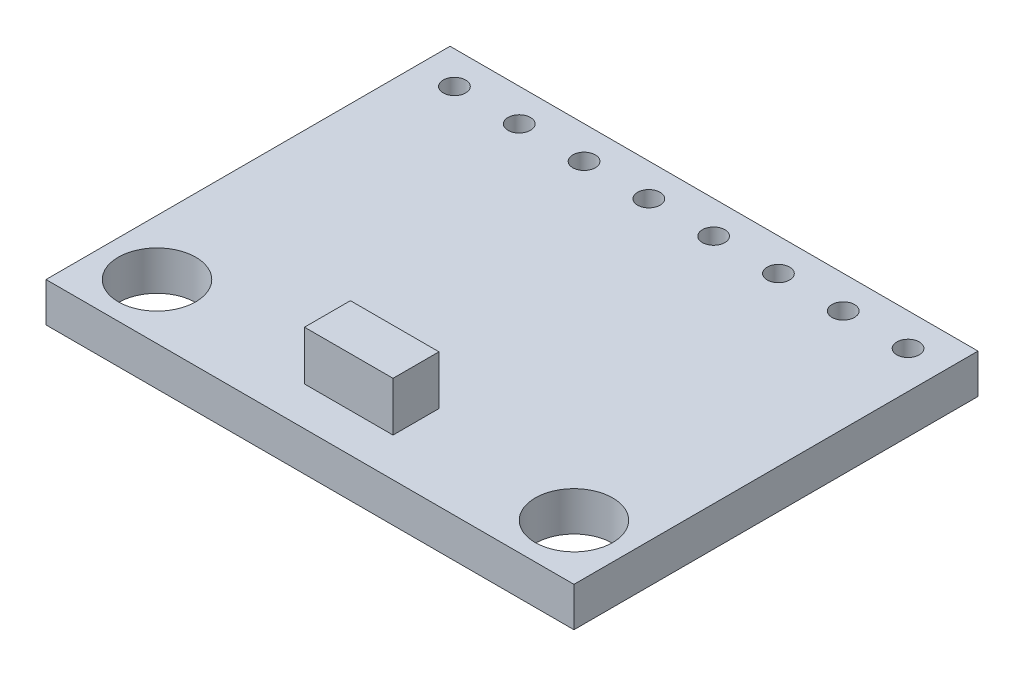
ISO-10303-21;
HEADER;
FILE_DESCRIPTION(('STEP AP214'),'2;1');
FILE_NAME('part.step','',(''),(''),'','','');
FILE_SCHEMA(('AUTOMOTIVE_DESIGN { 1 0 10303 214 1 1 1 1 }'));
ENDSEC;
DATA;
#1=APPLICATION_CONTEXT('core data for automotive mechanical design processes');
#2=APPLICATION_PROTOCOL_DEFINITION('international standard','automotive_design',2000,#1);
#3=PRODUCT_CONTEXT('',#1,'mechanical');
#4=PRODUCT('Part','Part','',(#3));
#5=PRODUCT_RELATED_PRODUCT_CATEGORY('part','',(#4));
#6=PRODUCT_DEFINITION_FORMATION('','',#4);
#7=PRODUCT_DEFINITION_CONTEXT('part definition',#1,'design');
#8=PRODUCT_DEFINITION('design','',#6,#7);
#9=PRODUCT_DEFINITION_SHAPE('','',#8);
#10=(LENGTH_UNIT() NAMED_UNIT(*) SI_UNIT(.MILLI.,.METRE.));
#11=(NAMED_UNIT(*) PLANE_ANGLE_UNIT() SI_UNIT($,.RADIAN.));
#12=(NAMED_UNIT(*) SI_UNIT($,.STERADIAN.) SOLID_ANGLE_UNIT());
#13=UNCERTAINTY_MEASURE_WITH_UNIT(LENGTH_MEASURE(1.E-05),#10,'distance_accuracy_value','');
#14=(GEOMETRIC_REPRESENTATION_CONTEXT(3) GLOBAL_UNCERTAINTY_ASSIGNED_CONTEXT((#13)) GLOBAL_UNIT_ASSIGNED_CONTEXT((#10,
#11,#12)) REPRESENTATION_CONTEXT('',''));
#15=CARTESIAN_POINT('',(0.,0.,0.));
#16=DIRECTION('',(0.,0.,1.));
#17=DIRECTION('',(1.,0.,0.));
#18=AXIS2_PLACEMENT_3D('',#15,#16,#17);
#19=CARTESIAN_POINT('',(0.,1.524,0.));
#20=DIRECTION('',(0.,-1.,0.));
#21=DIRECTION('',(0.,0.,-1.));
#22=AXIS2_PLACEMENT_3D('',#19,#20,#21);
#23=PLANE('',#22);
#24=CARTESIAN_POINT('',(19.005,1.524,-14.385));
#25=DIRECTION('',(0.,1.,0.));
#26=DIRECTION('',(0.,0.,1.));
#27=AXIS2_PLACEMENT_3D('',#24,#25,#26);
#28=CIRCLE('',#27,0.435);
#29=CARTESIAN_POINT('',(19.005,1.524,-13.95));
#30=VERTEX_POINT('',#29);
#31=EDGE_CURVE('E140',#30,#30,#28,.T.);
#32=ORIENTED_EDGE('',*,*,#31,.F.);
#33=EDGE_LOOP('',(#32));
#34=FACE_BOUND('',#33,.T.);
#35=CARTESIAN_POINT('',(16.495,1.524,-14.385));
#36=DIRECTION('',(0.,1.,0.));
#37=DIRECTION('',(0.,0.,1.));
#38=AXIS2_PLACEMENT_3D('',#35,#36,#37);
#39=CIRCLE('',#38,0.434999999999993);
#40=CARTESIAN_POINT('',(16.495,1.524,-13.95));
#41=VERTEX_POINT('',#40);
#42=EDGE_CURVE('E149',#41,#41,#39,.T.);
#43=ORIENTED_EDGE('',*,*,#42,.F.);
#44=EDGE_LOOP('',(#43));
#45=FACE_BOUND('',#44,.T.);
#46=CARTESIAN_POINT('',(3.94500000000001,1.524,-14.385));
#47=DIRECTION('',(0.,1.,0.));
#48=DIRECTION('',(0.,0.,1.));
#49=AXIS2_PLACEMENT_3D('',#46,#47,#48);
#50=CIRCLE('',#49,0.435000000000001);
#51=CARTESIAN_POINT('',(3.94500000000001,1.524,-13.95));
#52=VERTEX_POINT('',#51);
#53=EDGE_CURVE('E155',#52,#52,#50,.T.);
#54=ORIENTED_EDGE('',*,*,#53,.F.);
#55=EDGE_LOOP('',(#54));
#56=FACE_BOUND('',#55,.T.);
#57=CARTESIAN_POINT('',(11.475,1.524,-14.385));
#58=DIRECTION('',(0.,1.,0.));
#59=DIRECTION('',(0.,0.,1.));
#60=AXIS2_PLACEMENT_3D('',#57,#58,#59);
#61=CIRCLE('',#60,0.435);
#62=CARTESIAN_POINT('',(11.475,1.524,-13.95));
#63=VERTEX_POINT('',#62);
#64=EDGE_CURVE('E161',#63,#63,#61,.T.);
#65=ORIENTED_EDGE('',*,*,#64,.F.);
#66=EDGE_LOOP('',(#65));
#67=FACE_BOUND('',#66,.T.);
#68=CARTESIAN_POINT('',(13.985,1.524,-14.385));
#69=DIRECTION('',(0.,1.,0.));
#70=DIRECTION('',(0.,0.,1.));
#71=AXIS2_PLACEMENT_3D('',#68,#69,#70);
#72=CIRCLE('',#71,0.435);
#73=CARTESIAN_POINT('',(13.985,1.524,-13.95));
#74=VERTEX_POINT('',#73);
#75=EDGE_CURVE('E167',#74,#74,#72,.T.);
#76=ORIENTED_EDGE('',*,*,#75,.F.);
#77=EDGE_LOOP('',(#76));
#78=FACE_BOUND('',#77,.T.);
#79=CARTESIAN_POINT('',(6.45500000000001,1.524,-14.385));
#80=DIRECTION('',(0.,1.,0.));
#81=DIRECTION('',(0.,0.,1.));
#82=AXIS2_PLACEMENT_3D('',#79,#80,#81);
#83=CIRCLE('',#82,0.435);
#84=CARTESIAN_POINT('',(6.45500000000001,1.524,-13.95));
#85=VERTEX_POINT('',#84);
#86=EDGE_CURVE('E173',#85,#85,#83,.T.);
#87=ORIENTED_EDGE('',*,*,#86,.F.);
#88=EDGE_LOOP('',(#87));
#89=FACE_BOUND('',#88,.T.);
#90=CARTESIAN_POINT('',(1.43500000000001,1.524,-14.385));
#91=DIRECTION('',(0.,1.,0.));
#92=DIRECTION('',(0.,0.,1.));
#93=AXIS2_PLACEMENT_3D('',#90,#91,#92);
#94=CIRCLE('',#93,0.435);
#95=CARTESIAN_POINT('',(1.43500000000001,1.524,-13.95));
#96=VERTEX_POINT('',#95);
#97=EDGE_CURVE('E179',#96,#96,#94,.T.);
#98=ORIENTED_EDGE('',*,*,#97,.F.);
#99=EDGE_LOOP('',(#98));
#100=FACE_BOUND('',#99,.T.);
#101=CARTESIAN_POINT('',(8.96500000000001,1.524,-14.385));
#102=DIRECTION('',(0.,1.,0.));
#103=DIRECTION('',(0.,0.,1.));
#104=AXIS2_PLACEMENT_3D('',#101,#102,#103);
#105=CIRCLE('',#104,0.435);
#106=CARTESIAN_POINT('',(8.96500000000001,1.524,-13.95));
#107=VERTEX_POINT('',#106);
#108=EDGE_CURVE('E185',#107,#107,#105,.T.);
#109=ORIENTED_EDGE('',*,*,#108,.F.);
#110=EDGE_LOOP('',(#109));
#111=FACE_BOUND('',#110,.T.);
#112=CARTESIAN_POINT('',(18.3,1.524,-2.15));
#113=DIRECTION('',(0.,1.,0.));
#114=DIRECTION('',(0.,0.,1.));
#115=AXIS2_PLACEMENT_3D('',#112,#113,#114);
#116=CIRCLE('',#115,1.5);
#117=CARTESIAN_POINT('',(18.3,1.524,-0.650000000000001));
#118=VERTEX_POINT('',#117);
#119=EDGE_CURVE('E191',#118,#118,#116,.T.);
#120=ORIENTED_EDGE('',*,*,#119,.F.);
#121=EDGE_LOOP('',(#120));
#122=FACE_BOUND('',#121,.T.);
#123=CARTESIAN_POINT('',(2.15,1.524,-2.15));
#124=DIRECTION('',(0.,1.,0.));
#125=DIRECTION('',(0.,0.,1.));
#126=AXIS2_PLACEMENT_3D('',#123,#124,#125);
#127=CIRCLE('',#126,1.5);
#128=CARTESIAN_POINT('',(2.15,1.524,-0.65));
#129=VERTEX_POINT('',#128);
#130=EDGE_CURVE('E197',#129,#129,#127,.T.);
#131=ORIENTED_EDGE('',*,*,#130,.F.);
#132=EDGE_LOOP('',(#131));
#133=FACE_BOUND('',#132,.T.);
#134=DIRECTION('',(0.,0.,1.));
#135=VECTOR('',#134,1.);
#136=CARTESIAN_POINT('',(0.,1.524,0.));
#137=LINE('',#136,#135);
#138=CARTESIAN_POINT('',(0.,1.524,-15.65));
#139=VERTEX_POINT('',#138);
#140=CARTESIAN_POINT('',(0.,1.524,0.));
#141=VERTEX_POINT('',#140);
#142=EDGE_CURVE('E203',#139,#141,#137,.T.);
#143=ORIENTED_EDGE('',*,*,#142,.T.);
#144=DIRECTION('',(1.,0.,0.));
#145=VECTOR('',#144,1.);
#146=CARTESIAN_POINT('',(0.,1.524,0.));
#147=LINE('',#146,#145);
#148=CARTESIAN_POINT('',(20.45,1.524,0.));
#149=VERTEX_POINT('',#148);
#150=EDGE_CURVE('E206',#141,#149,#147,.T.);
#151=ORIENTED_EDGE('',*,*,#150,.T.);
#152=DIRECTION('',(0.,0.,-1.));
#153=VECTOR('',#152,1.);
#154=CARTESIAN_POINT('',(20.45,1.524,0.));
#155=LINE('',#154,#153);
#156=CARTESIAN_POINT('',(20.45,1.524,-15.65));
#157=VERTEX_POINT('',#156);
#158=EDGE_CURVE('E209',#149,#157,#155,.T.);
#159=ORIENTED_EDGE('',*,*,#158,.T.);
#160=DIRECTION('',(-1.,0.,0.));
#161=VECTOR('',#160,1.);
#162=CARTESIAN_POINT('',(0.,1.524,-15.65));
#163=LINE('',#162,#161);
#164=EDGE_CURVE('E211',#157,#139,#163,.T.);
#165=ORIENTED_EDGE('',*,*,#164,.T.);
#166=EDGE_LOOP('',(#143,#151,#159,#165));
#167=FACE_BOUND('',#166,.T.);
#168=DIRECTION('',(0.,0.,1.));
#169=VECTOR('',#168,1.);
#170=CARTESIAN_POINT('',(8.5105,1.524,-3.28036426337536));
#171=LINE('',#170,#169);
#172=CARTESIAN_POINT('',(8.5105,1.524,-3.28036426337536));
#173=VERTEX_POINT('',#172);
#174=CARTESIAN_POINT('',(8.5105,1.524,-1.50236426337536));
#175=VERTEX_POINT('',#174);
#176=EDGE_CURVE('E136',#173,#175,#171,.T.);
#177=ORIENTED_EDGE('',*,*,#176,.F.);
#178=DIRECTION('',(-1.,0.,0.));
#179=VECTOR('',#178,1.);
#180=CARTESIAN_POINT('',(8.5105,1.524,-3.28036426337536));
#181=LINE('',#180,#179);
#182=CARTESIAN_POINT('',(11.9395,1.524,-3.28036426337536));
#183=VERTEX_POINT('',#182);
#184=EDGE_CURVE('E133',#183,#173,#181,.T.);
#185=ORIENTED_EDGE('',*,*,#184,.F.);
#186=DIRECTION('',(0.,0.,-1.));
#187=VECTOR('',#186,1.);
#188=CARTESIAN_POINT('',(11.9395,1.524,-3.28036426337536));
#189=LINE('',#188,#187);
#190=CARTESIAN_POINT('',(11.9395,1.524,-1.50236426337536));
#191=VERTEX_POINT('',#190);
#192=EDGE_CURVE('E71',#191,#183,#189,.T.);
#193=ORIENTED_EDGE('',*,*,#192,.F.);
#194=DIRECTION('',(1.,0.,0.));
#195=VECTOR('',#194,1.);
#196=CARTESIAN_POINT('',(8.5105,1.524,-1.50236426337536));
#197=LINE('',#196,#195);
#198=EDGE_CURVE('E66',#175,#191,#197,.T.);
#199=ORIENTED_EDGE('',*,*,#198,.F.);
#200=EDGE_LOOP('',(#177,#185,#193,#199));
#201=FACE_BOUND('',#200,.T.);
#202=ADVANCED_FACE('F51',(#34,#45,#56,#67,#78,#89,#100,#111,#122,#133,#167,#201),#23,.F.);
#203=CARTESIAN_POINT('',(0.,0.,0.));
#204=DIRECTION('',(0.,-1.,0.));
#205=DIRECTION('',(0.,0.,-1.));
#206=AXIS2_PLACEMENT_3D('',#203,#204,#205);
#207=PLANE('',#206);
#208=CARTESIAN_POINT('',(16.495,0.,-14.385));
#209=DIRECTION('',(0.,1.,0.));
#210=DIRECTION('',(0.,0.,1.));
#211=AXIS2_PLACEMENT_3D('',#208,#209,#210);
#212=CIRCLE('',#211,0.434999999999993);
#213=CARTESIAN_POINT('',(16.495,0.,-13.95));
#214=VERTEX_POINT('',#213);
#215=EDGE_CURVE('E147',#214,#214,#212,.T.);
#216=ORIENTED_EDGE('',*,*,#215,.T.);
#217=EDGE_LOOP('',(#216));
#218=FACE_BOUND('',#217,.T.);
#219=CARTESIAN_POINT('',(11.475,0.,-14.385));
#220=DIRECTION('',(0.,1.,0.));
#221=DIRECTION('',(0.,0.,1.));
#222=AXIS2_PLACEMENT_3D('',#219,#220,#221);
#223=CIRCLE('',#222,0.435);
#224=CARTESIAN_POINT('',(11.475,0.,-13.95));
#225=VERTEX_POINT('',#224);
#226=EDGE_CURVE('E158',#225,#225,#223,.T.);
#227=ORIENTED_EDGE('',*,*,#226,.T.);
#228=EDGE_LOOP('',(#227));
#229=FACE_BOUND('',#228,.T.);
#230=CARTESIAN_POINT('',(6.45500000000001,0.,-14.385));
#231=DIRECTION('',(0.,1.,0.));
#232=DIRECTION('',(0.,0.,1.));
#233=AXIS2_PLACEMENT_3D('',#230,#231,#232);
#234=CIRCLE('',#233,0.435);
#235=CARTESIAN_POINT('',(6.45500000000001,0.,-13.95));
#236=VERTEX_POINT('',#235);
#237=EDGE_CURVE('E170',#236,#236,#234,.T.);
#238=ORIENTED_EDGE('',*,*,#237,.T.);
#239=EDGE_LOOP('',(#238));
#240=FACE_BOUND('',#239,.T.);
#241=CARTESIAN_POINT('',(8.96500000000001,0.,-14.385));
#242=DIRECTION('',(0.,1.,0.));
#243=DIRECTION('',(0.,0.,1.));
#244=AXIS2_PLACEMENT_3D('',#241,#242,#243);
#245=CIRCLE('',#244,0.435);
#246=CARTESIAN_POINT('',(8.96500000000001,0.,-13.95));
#247=VERTEX_POINT('',#246);
#248=EDGE_CURVE('E182',#247,#247,#245,.T.);
#249=ORIENTED_EDGE('',*,*,#248,.T.);
#250=EDGE_LOOP('',(#249));
#251=FACE_BOUND('',#250,.T.);
#252=CARTESIAN_POINT('',(2.15,0.,-2.15));
#253=DIRECTION('',(0.,1.,0.));
#254=DIRECTION('',(0.,0.,1.));
#255=AXIS2_PLACEMENT_3D('',#252,#253,#254);
#256=CIRCLE('',#255,1.5);
#257=CARTESIAN_POINT('',(2.15,0.,-0.65));
#258=VERTEX_POINT('',#257);
#259=EDGE_CURVE('E194',#258,#258,#256,.T.);
#260=ORIENTED_EDGE('',*,*,#259,.T.);
#261=EDGE_LOOP('',(#260));
#262=FACE_BOUND('',#261,.T.);
#263=DIRECTION('',(0.,0.,1.));
#264=VECTOR('',#263,1.);
#265=CARTESIAN_POINT('',(0.,0.,0.));
#266=LINE('',#265,#264);
#267=CARTESIAN_POINT('',(0.,0.,-15.65));
#268=VERTEX_POINT('',#267);
#269=CARTESIAN_POINT('',(0.,0.,0.));
#270=VERTEX_POINT('',#269);
#271=EDGE_CURVE('E200',#268,#270,#266,.T.);
#272=ORIENTED_EDGE('',*,*,#271,.F.);
#273=DIRECTION('',(-1.,0.,0.));
#274=VECTOR('',#273,1.);
#275=CARTESIAN_POINT('',(0.,0.,-15.65));
#276=LINE('',#275,#274);
#277=CARTESIAN_POINT('',(20.45,0.,-15.65));
#278=VERTEX_POINT('',#277);
#279=EDGE_CURVE('E207',#278,#268,#276,.T.);
#280=ORIENTED_EDGE('',*,*,#279,.F.);
#281=DIRECTION('',(0.,0.,-1.));
#282=VECTOR('',#281,1.);
#283=CARTESIAN_POINT('',(20.45,0.,0.));
#284=LINE('',#283,#282);
#285=CARTESIAN_POINT('',(20.45,0.,0.));
#286=VERTEX_POINT('',#285);
#287=EDGE_CURVE('E218',#286,#278,#284,.T.);
#288=ORIENTED_EDGE('',*,*,#287,.F.);
#289=DIRECTION('',(1.,0.,0.));
#290=VECTOR('',#289,1.);
#291=CARTESIAN_POINT('',(0.,0.,0.));
#292=LINE('',#291,#290);
#293=EDGE_CURVE('E216',#270,#286,#292,.T.);
#294=ORIENTED_EDGE('',*,*,#293,.F.);
#295=EDGE_LOOP('',(#272,#280,#288,#294));
#296=FACE_BOUND('',#295,.T.);
#297=CARTESIAN_POINT('',(18.3,0.,-2.15));
#298=DIRECTION('',(0.,1.,0.));
#299=DIRECTION('',(0.,0.,1.));
#300=AXIS2_PLACEMENT_3D('',#297,#298,#299);
#301=CIRCLE('',#300,1.5);
#302=CARTESIAN_POINT('',(18.3,0.,-0.650000000000001));
#303=VERTEX_POINT('',#302);
#304=EDGE_CURVE('E188',#303,#303,#301,.T.);
#305=ORIENTED_EDGE('',*,*,#304,.T.);
#306=EDGE_LOOP('',(#305));
#307=FACE_BOUND('',#306,.T.);
#308=CARTESIAN_POINT('',(1.43500000000001,0.,-14.385));
#309=DIRECTION('',(0.,1.,0.));
#310=DIRECTION('',(0.,0.,1.));
#311=AXIS2_PLACEMENT_3D('',#308,#309,#310);
#312=CIRCLE('',#311,0.435);
#313=CARTESIAN_POINT('',(1.43500000000001,0.,-13.95));
#314=VERTEX_POINT('',#313);
#315=EDGE_CURVE('E176',#314,#314,#312,.T.);
#316=ORIENTED_EDGE('',*,*,#315,.T.);
#317=EDGE_LOOP('',(#316));
#318=FACE_BOUND('',#317,.T.);
#319=CARTESIAN_POINT('',(13.985,0.,-14.385));
#320=DIRECTION('',(0.,1.,0.));
#321=DIRECTION('',(0.,0.,1.));
#322=AXIS2_PLACEMENT_3D('',#319,#320,#321);
#323=CIRCLE('',#322,0.435);
#324=CARTESIAN_POINT('',(13.985,0.,-13.95));
#325=VERTEX_POINT('',#324);
#326=EDGE_CURVE('E164',#325,#325,#323,.T.);
#327=ORIENTED_EDGE('',*,*,#326,.T.);
#328=EDGE_LOOP('',(#327));
#329=FACE_BOUND('',#328,.T.);
#330=CARTESIAN_POINT('',(3.94500000000001,0.,-14.385));
#331=DIRECTION('',(0.,1.,0.));
#332=DIRECTION('',(0.,0.,1.));
#333=AXIS2_PLACEMENT_3D('',#330,#331,#332);
#334=CIRCLE('',#333,0.435000000000001);
#335=CARTESIAN_POINT('',(3.94500000000001,0.,-13.95));
#336=VERTEX_POINT('',#335);
#337=EDGE_CURVE('E152',#336,#336,#334,.T.);
#338=ORIENTED_EDGE('',*,*,#337,.T.);
#339=EDGE_LOOP('',(#338));
#340=FACE_BOUND('',#339,.T.);
#341=CARTESIAN_POINT('',(19.005,0.,-14.385));
#342=DIRECTION('',(0.,1.,0.));
#343=DIRECTION('',(0.,0.,1.));
#344=AXIS2_PLACEMENT_3D('',#341,#342,#343);
#345=CIRCLE('',#344,0.435);
#346=CARTESIAN_POINT('',(19.005,0.,-13.95));
#347=VERTEX_POINT('',#346);
#348=EDGE_CURVE('E137',#347,#347,#345,.T.);
#349=ORIENTED_EDGE('',*,*,#348,.T.);
#350=EDGE_LOOP('',(#349));
#351=FACE_BOUND('',#350,.T.);
#352=ADVANCED_FACE('F236',(#218,#229,#240,#251,#262,#296,#307,#318,#329,#340,#351),#207,.T.);
#353=CARTESIAN_POINT('',(0.,1.524,0.));
#354=DIRECTION('',(1.,0.,0.));
#355=DIRECTION('',(0.,0.,-1.));
#356=AXIS2_PLACEMENT_3D('',#353,#354,#355);
#357=PLANE('',#356);
#358=ORIENTED_EDGE('',*,*,#271,.T.);
#359=DIRECTION('',(0.,-1.,0.));
#360=VECTOR('',#359,1.);
#361=CARTESIAN_POINT('',(0.,1.524,0.));
#362=LINE('',#361,#360);
#363=EDGE_CURVE('E11',#141,#270,#362,.T.);
#364=ORIENTED_EDGE('',*,*,#363,.F.);
#365=ORIENTED_EDGE('',*,*,#142,.F.);
#366=DIRECTION('',(0.,-1.,0.));
#367=VECTOR('',#366,1.);
#368=CARTESIAN_POINT('',(0.,1.524,-15.65));
#369=LINE('',#368,#367);
#370=EDGE_CURVE('E213',#139,#268,#369,.T.);
#371=ORIENTED_EDGE('',*,*,#370,.T.);
#372=EDGE_LOOP('',(#358,#364,#365,#371));
#373=FACE_BOUND('',#372,.T.);
#374=ADVANCED_FACE('F53',(#373),#357,.F.);
#375=CARTESIAN_POINT('',(0.,1.524,0.));
#376=DIRECTION('',(0.,0.,-1.));
#377=DIRECTION('',(-1.,0.,0.));
#378=AXIS2_PLACEMENT_3D('',#375,#376,#377);
#379=PLANE('',#378);
#380=ORIENTED_EDGE('',*,*,#293,.T.);
#381=DIRECTION('',(0.,-1.,0.));
#382=VECTOR('',#381,1.);
#383=CARTESIAN_POINT('',(20.45,1.524,0.));
#384=LINE('',#383,#382);
#385=EDGE_CURVE('E59',#149,#286,#384,.T.);
#386=ORIENTED_EDGE('',*,*,#385,.F.);
#387=ORIENTED_EDGE('',*,*,#150,.F.);
#388=ORIENTED_EDGE('',*,*,#363,.T.);
#389=EDGE_LOOP('',(#380,#386,#387,#388));
#390=FACE_BOUND('',#389,.T.);
#391=ADVANCED_FACE('F246',(#390),#379,.F.);
#392=CARTESIAN_POINT('',(20.45,1.524,0.));
#393=DIRECTION('',(-1.,0.,0.));
#394=DIRECTION('',(0.,0.,1.));
#395=AXIS2_PLACEMENT_3D('',#392,#393,#394);
#396=PLANE('',#395);
#397=ORIENTED_EDGE('',*,*,#287,.T.);
#398=DIRECTION('',(0.,-1.,0.));
#399=VECTOR('',#398,1.);
#400=CARTESIAN_POINT('',(20.45,1.524,-15.65));
#401=LINE('',#400,#399);
#402=EDGE_CURVE('E223',#157,#278,#401,.T.);
#403=ORIENTED_EDGE('',*,*,#402,.F.);
#404=ORIENTED_EDGE('',*,*,#158,.F.);
#405=ORIENTED_EDGE('',*,*,#385,.T.);
#406=EDGE_LOOP('',(#397,#403,#404,#405));
#407=FACE_BOUND('',#406,.T.);
#408=ADVANCED_FACE('F230',(#407),#396,.F.);
#409=CARTESIAN_POINT('',(0.,1.524,-15.65));
#410=DIRECTION('',(0.,0.,1.));
#411=DIRECTION('',(1.,0.,0.));
#412=AXIS2_PLACEMENT_3D('',#409,#410,#411);
#413=PLANE('',#412);
#414=ORIENTED_EDGE('',*,*,#279,.T.);
#415=ORIENTED_EDGE('',*,*,#370,.F.);
#416=ORIENTED_EDGE('',*,*,#164,.F.);
#417=ORIENTED_EDGE('',*,*,#402,.T.);
#418=EDGE_LOOP('',(#414,#415,#416,#417));
#419=FACE_BOUND('',#418,.T.);
#420=ADVANCED_FACE('F240',(#419),#413,.F.);
#421=CARTESIAN_POINT('',(2.15,1.524,-2.15));
#422=DIRECTION('',(0.,-1.,0.));
#423=DIRECTION('',(0.,0.,-1.));
#424=AXIS2_PLACEMENT_3D('',#421,#422,#423);
#425=CYLINDRICAL_SURFACE('',#424,1.5);
#426=ORIENTED_EDGE('',*,*,#130,.T.);
#427=EDGE_LOOP('',(#426));
#428=FACE_BOUND('',#427,.T.);
#429=ORIENTED_EDGE('',*,*,#259,.F.);
#430=EDGE_LOOP('',(#429));
#431=FACE_BOUND('',#430,.T.);
#432=ADVANCED_FACE('F266',(#428,#431),#425,.F.);
#433=CARTESIAN_POINT('',(18.3,1.524,-2.15));
#434=DIRECTION('',(0.,-1.,0.));
#435=DIRECTION('',(0.,0.,-1.));
#436=AXIS2_PLACEMENT_3D('',#433,#434,#435);
#437=CYLINDRICAL_SURFACE('',#436,1.5);
#438=ORIENTED_EDGE('',*,*,#119,.T.);
#439=EDGE_LOOP('',(#438));
#440=FACE_BOUND('',#439,.T.);
#441=ORIENTED_EDGE('',*,*,#304,.F.);
#442=EDGE_LOOP('',(#441));
#443=FACE_BOUND('',#442,.T.);
#444=ADVANCED_FACE('F273',(#440,#443),#437,.F.);
#445=CARTESIAN_POINT('',(8.96500000000001,1.524,-14.385));
#446=DIRECTION('',(0.,-1.,0.));
#447=DIRECTION('',(0.,0.,-1.));
#448=AXIS2_PLACEMENT_3D('',#445,#446,#447);
#449=CYLINDRICAL_SURFACE('',#448,0.435);
#450=ORIENTED_EDGE('',*,*,#108,.T.);
#451=EDGE_LOOP('',(#450));
#452=FACE_BOUND('',#451,.T.);
#453=ORIENTED_EDGE('',*,*,#248,.F.);
#454=EDGE_LOOP('',(#453));
#455=FACE_BOUND('',#454,.T.);
#456=ADVANCED_FACE('F278',(#452,#455),#449,.F.);
#457=CARTESIAN_POINT('',(1.43500000000001,1.524,-14.385));
#458=DIRECTION('',(0.,-1.,0.));
#459=DIRECTION('',(0.,0.,-1.));
#460=AXIS2_PLACEMENT_3D('',#457,#458,#459);
#461=CYLINDRICAL_SURFACE('',#460,0.435);
#462=ORIENTED_EDGE('',*,*,#97,.T.);
#463=EDGE_LOOP('',(#462));
#464=FACE_BOUND('',#463,.T.);
#465=ORIENTED_EDGE('',*,*,#315,.F.);
#466=EDGE_LOOP('',(#465));
#467=FACE_BOUND('',#466,.T.);
#468=ADVANCED_FACE('F288',(#464,#467),#461,.F.);
#469=CARTESIAN_POINT('',(6.45500000000001,1.524,-14.385));
#470=DIRECTION('',(0.,-1.,0.));
#471=DIRECTION('',(0.,0.,-1.));
#472=AXIS2_PLACEMENT_3D('',#469,#470,#471);
#473=CYLINDRICAL_SURFACE('',#472,0.435);
#474=ORIENTED_EDGE('',*,*,#86,.T.);
#475=EDGE_LOOP('',(#474));
#476=FACE_BOUND('',#475,.T.);
#477=ORIENTED_EDGE('',*,*,#237,.F.);
#478=EDGE_LOOP('',(#477));
#479=FACE_BOUND('',#478,.T.);
#480=ADVANCED_FACE('F295',(#476,#479),#473,.F.);
#481=CARTESIAN_POINT('',(13.985,1.524,-14.385));
#482=DIRECTION('',(0.,-1.,0.));
#483=DIRECTION('',(0.,0.,-1.));
#484=AXIS2_PLACEMENT_3D('',#481,#482,#483);
#485=CYLINDRICAL_SURFACE('',#484,0.435);
#486=ORIENTED_EDGE('',*,*,#75,.T.);
#487=EDGE_LOOP('',(#486));
#488=FACE_BOUND('',#487,.T.);
#489=ORIENTED_EDGE('',*,*,#326,.F.);
#490=EDGE_LOOP('',(#489));
#491=FACE_BOUND('',#490,.T.);
#492=ADVANCED_FACE('F299',(#488,#491),#485,.F.);
#493=CARTESIAN_POINT('',(11.475,1.524,-14.385));
#494=DIRECTION('',(0.,-1.,0.));
#495=DIRECTION('',(0.,0.,-1.));
#496=AXIS2_PLACEMENT_3D('',#493,#494,#495);
#497=CYLINDRICAL_SURFACE('',#496,0.435);
#498=ORIENTED_EDGE('',*,*,#64,.T.);
#499=EDGE_LOOP('',(#498));
#500=FACE_BOUND('',#499,.T.);
#501=ORIENTED_EDGE('',*,*,#226,.F.);
#502=EDGE_LOOP('',(#501));
#503=FACE_BOUND('',#502,.T.);
#504=ADVANCED_FACE('F303',(#500,#503),#497,.F.);
#505=CARTESIAN_POINT('',(3.94500000000001,1.524,-14.385));
#506=DIRECTION('',(0.,-1.,0.));
#507=DIRECTION('',(0.,0.,-1.));
#508=AXIS2_PLACEMENT_3D('',#505,#506,#507);
#509=CYLINDRICAL_SURFACE('',#508,0.435000000000001);
#510=ORIENTED_EDGE('',*,*,#53,.T.);
#511=EDGE_LOOP('',(#510));
#512=FACE_BOUND('',#511,.T.);
#513=ORIENTED_EDGE('',*,*,#337,.F.);
#514=EDGE_LOOP('',(#513));
#515=FACE_BOUND('',#514,.T.);
#516=ADVANCED_FACE('F307',(#512,#515),#509,.F.);
#517=CARTESIAN_POINT('',(16.495,1.524,-14.385));
#518=DIRECTION('',(0.,-1.,0.));
#519=DIRECTION('',(0.,0.,-1.));
#520=AXIS2_PLACEMENT_3D('',#517,#518,#519);
#521=CYLINDRICAL_SURFACE('',#520,0.434999999999993);
#522=ORIENTED_EDGE('',*,*,#42,.T.);
#523=EDGE_LOOP('',(#522));
#524=FACE_BOUND('',#523,.T.);
#525=ORIENTED_EDGE('',*,*,#215,.F.);
#526=EDGE_LOOP('',(#525));
#527=FACE_BOUND('',#526,.T.);
#528=ADVANCED_FACE('F311',(#524,#527),#521,.F.);
#529=CARTESIAN_POINT('',(19.005,1.524,-14.385));
#530=DIRECTION('',(0.,-1.,0.));
#531=DIRECTION('',(0.,0.,-1.));
#532=AXIS2_PLACEMENT_3D('',#529,#530,#531);
#533=CYLINDRICAL_SURFACE('',#532,0.435);
#534=ORIENTED_EDGE('',*,*,#31,.T.);
#535=EDGE_LOOP('',(#534));
#536=FACE_BOUND('',#535,.T.);
#537=ORIENTED_EDGE('',*,*,#348,.F.);
#538=EDGE_LOOP('',(#537));
#539=FACE_BOUND('',#538,.T.);
#540=ADVANCED_FACE('F315',(#536,#539),#533,.F.);
#541=CARTESIAN_POINT('',(8.5105,3.429,-3.28036426337536));
#542=DIRECTION('',(1.,0.,0.));
#543=DIRECTION('',(0.,0.,-1.));
#544=AXIS2_PLACEMENT_3D('',#541,#542,#543);
#545=PLANE('',#544);
#546=ORIENTED_EDGE('',*,*,#176,.T.);
#547=DIRECTION('',(0.,-1.,0.));
#548=VECTOR('',#547,1.);
#549=CARTESIAN_POINT('',(8.5105,3.429,-1.50236426337536));
#550=LINE('',#549,#548);
#551=CARTESIAN_POINT('',(8.5105,3.429,-1.50236426337536));
#552=VERTEX_POINT('',#551);
#553=EDGE_CURVE('E117',#552,#175,#550,.T.);
#554=ORIENTED_EDGE('',*,*,#553,.F.);
#555=DIRECTION('',(0.,0.,1.));
#556=VECTOR('',#555,1.);
#557=CARTESIAN_POINT('',(8.5105,3.429,-3.28036426337536));
#558=LINE('',#557,#556);
#559=CARTESIAN_POINT('',(8.5105,3.429,-3.28036426337536));
#560=VERTEX_POINT('',#559);
#561=EDGE_CURVE('E124',#560,#552,#558,.T.);
#562=ORIENTED_EDGE('',*,*,#561,.F.);
#563=DIRECTION('',(0.,-1.,0.));
#564=VECTOR('',#563,1.);
#565=CARTESIAN_POINT('',(8.5105,3.429,-3.28036426337536));
#566=LINE('',#565,#564);
#567=EDGE_CURVE('E479',#560,#173,#566,.T.);
#568=ORIENTED_EDGE('',*,*,#567,.T.);
#569=EDGE_LOOP('',(#546,#554,#562,#568));
#570=FACE_BOUND('',#569,.T.);
#571=ADVANCED_FACE('F135',(#570),#545,.F.);
#572=CARTESIAN_POINT('',(8.5105,3.429,-1.50236426337536));
#573=DIRECTION('',(0.,0.,-1.));
#574=DIRECTION('',(-1.,0.,0.));
#575=AXIS2_PLACEMENT_3D('',#572,#573,#574);
#576=PLANE('',#575);
#577=ORIENTED_EDGE('',*,*,#198,.T.);
#578=DIRECTION('',(0.,-1.,0.));
#579=VECTOR('',#578,1.);
#580=CARTESIAN_POINT('',(11.9395,3.429,-1.50236426337536));
#581=LINE('',#580,#579);
#582=CARTESIAN_POINT('',(11.9395,3.429,-1.50236426337536));
#583=VERTEX_POINT('',#582);
#584=EDGE_CURVE('E120',#583,#191,#581,.T.);
#585=ORIENTED_EDGE('',*,*,#584,.F.);
#586=DIRECTION('',(1.,0.,0.));
#587=VECTOR('',#586,1.);
#588=CARTESIAN_POINT('',(8.5105,3.429,-1.50236426337536));
#589=LINE('',#588,#587);
#590=EDGE_CURVE('E113',#552,#583,#589,.T.);
#591=ORIENTED_EDGE('',*,*,#590,.F.);
#592=ORIENTED_EDGE('',*,*,#553,.T.);
#593=EDGE_LOOP('',(#577,#585,#591,#592));
#594=FACE_BOUND('',#593,.T.);
#595=ADVANCED_FACE('F115',(#594),#576,.F.);
#596=CARTESIAN_POINT('',(11.9395,3.429,-3.28036426337536));
#597=DIRECTION('',(-1.,0.,0.));
#598=DIRECTION('',(0.,0.,1.));
#599=AXIS2_PLACEMENT_3D('',#596,#597,#598);
#600=PLANE('',#599);
#601=ORIENTED_EDGE('',*,*,#192,.T.);
#602=DIRECTION('',(0.,-1.,0.));
#603=VECTOR('',#602,1.);
#604=CARTESIAN_POINT('',(11.9395,3.429,-3.28036426337536));
#605=LINE('',#604,#603);
#606=CARTESIAN_POINT('',(11.9395,3.429,-3.28036426337536));
#607=VERTEX_POINT('',#606);
#608=EDGE_CURVE('E142',#607,#183,#605,.T.);
#609=ORIENTED_EDGE('',*,*,#608,.F.);
#610=DIRECTION('',(0.,0.,-1.));
#611=VECTOR('',#610,1.);
#612=CARTESIAN_POINT('',(11.9395,3.429,-3.28036426337536));
#613=LINE('',#612,#611);
#614=EDGE_CURVE('E123',#583,#607,#613,.T.);
#615=ORIENTED_EDGE('',*,*,#614,.F.);
#616=ORIENTED_EDGE('',*,*,#584,.T.);
#617=EDGE_LOOP('',(#601,#609,#615,#616));
#618=FACE_BOUND('',#617,.T.);
#619=ADVANCED_FACE('F323',(#618),#600,.F.);
#620=CARTESIAN_POINT('',(8.5105,3.429,-3.28036426337536));
#621=DIRECTION('',(0.,0.,1.));
#622=DIRECTION('',(1.,0.,0.));
#623=AXIS2_PLACEMENT_3D('',#620,#621,#622);
#624=PLANE('',#623);
#625=ORIENTED_EDGE('',*,*,#184,.T.);
#626=ORIENTED_EDGE('',*,*,#567,.F.);
#627=DIRECTION('',(-1.,0.,0.));
#628=VECTOR('',#627,1.);
#629=CARTESIAN_POINT('',(8.5105,3.429,-3.28036426337536));
#630=LINE('',#629,#628);
#631=EDGE_CURVE('E129',#607,#560,#630,.T.);
#632=ORIENTED_EDGE('',*,*,#631,.F.);
#633=ORIENTED_EDGE('',*,*,#608,.T.);
#634=EDGE_LOOP('',(#625,#626,#632,#633));
#635=FACE_BOUND('',#634,.T.);
#636=ADVANCED_FACE('F326',(#635),#624,.F.);
#637=CARTESIAN_POINT('',(0.,3.429,0.));
#638=DIRECTION('',(0.,1.,0.));
#639=DIRECTION('',(0.,0.,1.));
#640=AXIS2_PLACEMENT_3D('',#637,#638,#639);
#641=PLANE('',#640);
#642=ORIENTED_EDGE('',*,*,#561,.T.);
#643=ORIENTED_EDGE('',*,*,#590,.T.);
#644=ORIENTED_EDGE('',*,*,#614,.T.);
#645=ORIENTED_EDGE('',*,*,#631,.T.);
#646=EDGE_LOOP('',(#642,#643,#644,#645));
#647=FACE_BOUND('',#646,.T.);
#648=ADVANCED_FACE('F127',(#647),#641,.T.);
#649=CLOSED_SHELL('',(#202,#352,#374,#391,#408,#420,#432,#444,#456,#468,#480,#492,#504,#516,
#528,#540,#571,#595,#619,#636,#648));
#650=MANIFOLD_SOLID_BREP('B2',#649);
#651=ADVANCED_BREP_SHAPE_REPRESENTATION('',(#18,#650),#14);
#652=SHAPE_DEFINITION_REPRESENTATION(#9,#651);
ENDSEC;
END-ISO-10303-21;
